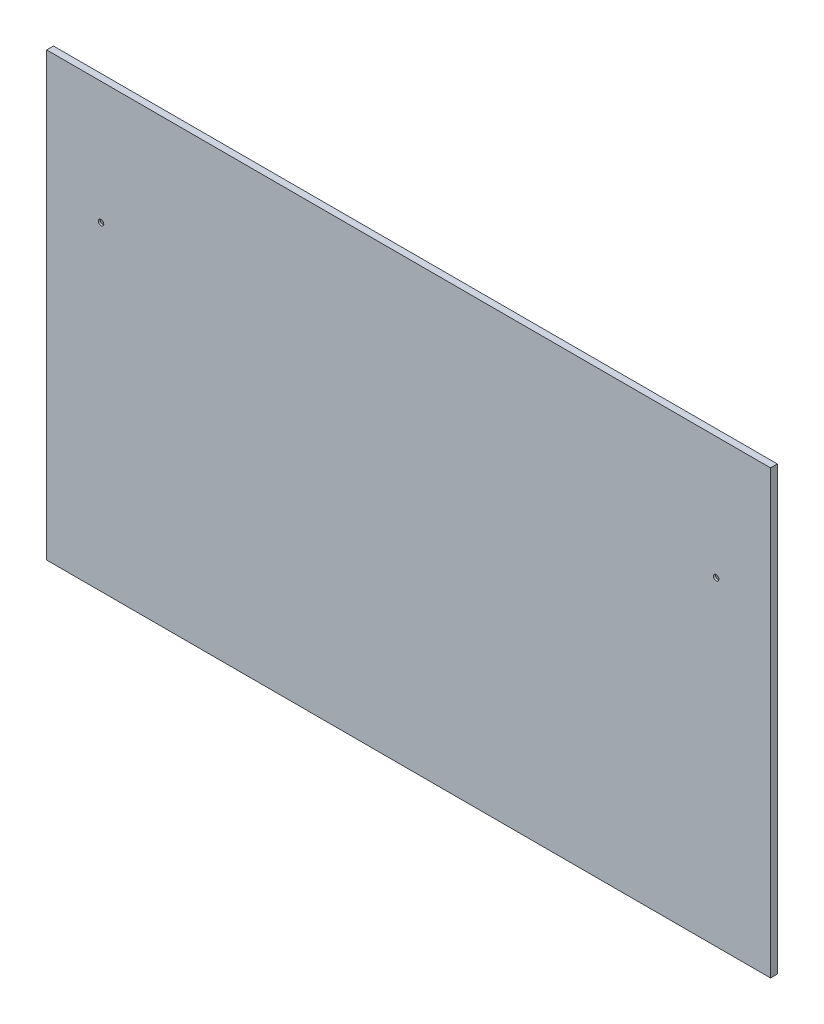
ISO-10303-21;
HEADER;
FILE_DESCRIPTION(('STEP AP214'),'2;1');
FILE_NAME('part.step','',(''),(''),'','','');
FILE_SCHEMA(('AUTOMOTIVE_DESIGN { 1 0 10303 214 1 1 1 1 }'));
ENDSEC;
DATA;
#1=APPLICATION_CONTEXT('core data for automotive mechanical design processes');
#2=APPLICATION_PROTOCOL_DEFINITION('international standard','automotive_design',2000,#1);
#3=PRODUCT_CONTEXT('',#1,'mechanical');
#4=PRODUCT('Part','Part','',(#3));
#5=PRODUCT_RELATED_PRODUCT_CATEGORY('part','',(#4));
#6=PRODUCT_DEFINITION_FORMATION('','',#4);
#7=PRODUCT_DEFINITION_CONTEXT('part definition',#1,'design');
#8=PRODUCT_DEFINITION('design','',#6,#7);
#9=PRODUCT_DEFINITION_SHAPE('','',#8);
#10=(LENGTH_UNIT() NAMED_UNIT(*) SI_UNIT(.MILLI.,.METRE.));
#11=(NAMED_UNIT(*) PLANE_ANGLE_UNIT() SI_UNIT($,.RADIAN.));
#12=(NAMED_UNIT(*) SI_UNIT($,.STERADIAN.) SOLID_ANGLE_UNIT());
#13=UNCERTAINTY_MEASURE_WITH_UNIT(LENGTH_MEASURE(1.E-05),#10,'distance_accuracy_value','');
#14=(GEOMETRIC_REPRESENTATION_CONTEXT(3) GLOBAL_UNCERTAINTY_ASSIGNED_CONTEXT((#13)) GLOBAL_UNIT_ASSIGNED_CONTEXT((#10,
#11,#12)) REPRESENTATION_CONTEXT('',''));
#15=CARTESIAN_POINT('',(0.,0.,0.));
#16=DIRECTION('',(0.,0.,1.));
#17=DIRECTION('',(1.,0.,0.));
#18=AXIS2_PLACEMENT_3D('',#15,#16,#17);
#19=CARTESIAN_POINT('',(0.,0.,0.));
#20=DIRECTION('',(0.,0.,1.));
#21=DIRECTION('',(1.,0.,0.));
#22=AXIS2_PLACEMENT_3D('',#19,#20,#21);
#23=PLANE('',#22);
#24=CARTESIAN_POINT('',(-287.3375,104.775,5.6843418860808E-11));
#25=DIRECTION('',(0.,0.,-1.));
#26=DIRECTION('',(-1.,0.,0.));
#27=AXIS2_PLACEMENT_3D('',#24,#25,#26);
#28=CIRCLE('',#27,6.43889999993525);
#29=CARTESIAN_POINT('',(-293.776399999935,104.775,5.6843418860808E-11));
#30=VERTEX_POINT('',#29);
#31=EDGE_CURVE('P0_E68',#30,#30,#28,.F.);
#32=ORIENTED_EDGE('',*,*,#31,.T.);
#33=EDGE_LOOP('',(#32));
#34=FACE_BOUND('',#33,.T.);
#35=CARTESIAN_POINT('',(287.3375,104.775,5.6843418860808E-11));
#36=DIRECTION('',(0.,0.,-1.));
#37=DIRECTION('',(-1.,0.,0.));
#38=AXIS2_PLACEMENT_3D('',#35,#36,#37);
#39=CIRCLE('',#38,6.43889999994869);
#40=CARTESIAN_POINT('',(280.898600000051,104.775,5.6843418860808E-11));
#41=VERTEX_POINT('',#40);
#42=EDGE_CURVE('P0_E19',#41,#41,#39,.F.);
#43=ORIENTED_EDGE('',*,*,#42,.T.);
#44=EDGE_LOOP('',(#43));
#45=FACE_BOUND('',#44,.T.);
#46=DIRECTION('',(0.,1.,0.));
#47=VECTOR('',#46,1.);
#48=CARTESIAN_POINT('',(338.1375,-193.675,0.));
#49=LINE('',#48,#47);
#50=CARTESIAN_POINT('',(338.1375,-193.675,0.));
#51=VERTEX_POINT('',#50);
#52=CARTESIAN_POINT('',(338.1375,219.075,0.));
#53=VERTEX_POINT('',#52);
#54=EDGE_CURVE('P0_E54',#51,#53,#49,.T.);
#55=ORIENTED_EDGE('',*,*,#54,.F.);
#56=DIRECTION('',(1.,0.,0.));
#57=VECTOR('',#56,1.);
#58=CARTESIAN_POINT('',(-338.1375,-193.675,0.));
#59=LINE('',#58,#57);
#60=CARTESIAN_POINT('',(-338.1375,-193.675,0.));
#61=VERTEX_POINT('',#60);
#62=EDGE_CURVE('P0_E59',#61,#51,#59,.T.);
#63=ORIENTED_EDGE('',*,*,#62,.F.);
#64=DIRECTION('',(0.,1.,0.));
#65=VECTOR('',#64,1.);
#66=CARTESIAN_POINT('',(-338.1375,219.075,0.));
#67=LINE('',#66,#65);
#68=CARTESIAN_POINT('',(-338.1375,219.075,0.));
#69=VERTEX_POINT('',#68);
#70=EDGE_CURVE('P0_E87',#69,#61,#67,.F.);
#71=ORIENTED_EDGE('',*,*,#70,.F.);
#72=DIRECTION('',(1.,0.,0.));
#73=VECTOR('',#72,1.);
#74=CARTESIAN_POINT('',(338.1375,219.075,0.));
#75=LINE('',#74,#73);
#76=EDGE_CURVE('P0_E70',#53,#69,#75,.F.);
#77=ORIENTED_EDGE('',*,*,#76,.F.);
#78=EDGE_LOOP('',(#55,#63,#71,#77));
#79=FACE_BOUND('',#78,.T.);
#80=ADVANCED_FACE('P0_F16',(#34,#45,#79),#23,.F.);
#81=CARTESIAN_POINT('',(287.3375,104.775,1.13686837721616E-10));
#82=DIRECTION('',(0.,0.,-1.));
#83=DIRECTION('',(-1.,0.,0.));
#84=AXIS2_PLACEMENT_3D('',#81,#82,#83);
#85=CONICAL_SURFACE('',#84,6.43889999989927,0.715584993311887);
#86=CARTESIAN_POINT('',(287.3375,104.775,4.47056170414192));
#87=DIRECTION('',(0.,0.,-1.));
#88=DIRECTION('',(-1.,0.,0.));
#89=AXIS2_PLACEMENT_3D('',#86,#87,#88);
#90=CIRCLE('',#89,2.5527);
#91=CARTESIAN_POINT('',(284.7848,104.775,4.47056170414192));
#92=VERTEX_POINT('',#91);
#93=EDGE_CURVE('P0_E85',#92,#92,#90,.F.);
#94=ORIENTED_EDGE('',*,*,#93,.T.);
#95=EDGE_LOOP('',(#94));
#96=FACE_BOUND('',#95,.T.);
#97=ORIENTED_EDGE('',*,*,#42,.F.);
#98=EDGE_LOOP('',(#97));
#99=FACE_BOUND('',#98,.T.);
#100=ADVANCED_FACE('P0_F98',(#96,#99),#85,.F.);
#101=CARTESIAN_POINT('',(-287.3375,104.775,1.13686837721616E-10));
#102=DIRECTION('',(0.,0.,-1.));
#103=DIRECTION('',(-1.,0.,0.));
#104=AXIS2_PLACEMENT_3D('',#101,#102,#103);
#105=CONICAL_SURFACE('',#104,6.43889999988584,0.715584993311887);
#106=CARTESIAN_POINT('',(-287.3375,104.775,4.47056170414192));
#107=DIRECTION('',(0.,0.,-1.));
#108=DIRECTION('',(-1.,0.,0.));
#109=AXIS2_PLACEMENT_3D('',#106,#107,#108);
#110=CIRCLE('',#109,2.5527);
#111=CARTESIAN_POINT('',(-289.8902,104.775,4.47056170414192));
#112=VERTEX_POINT('',#111);
#113=EDGE_CURVE('P0_E81',#112,#112,#110,.F.);
#114=ORIENTED_EDGE('',*,*,#113,.T.);
#115=EDGE_LOOP('',(#114));
#116=FACE_BOUND('',#115,.T.);
#117=ORIENTED_EDGE('',*,*,#31,.F.);
#118=EDGE_LOOP('',(#117));
#119=FACE_BOUND('',#118,.T.);
#120=ADVANCED_FACE('P0_F100',(#116,#119),#105,.F.);
#121=CARTESIAN_POINT('',(-338.1375,-193.675,0.));
#122=DIRECTION('',(0.,-1.,0.));
#123=DIRECTION('',(0.,0.,-1.));
#124=AXIS2_PLACEMENT_3D('',#121,#122,#123);
#125=PLANE('',#124);
#126=DIRECTION('',(0.,0.,1.));
#127=VECTOR('',#126,1.);
#128=CARTESIAN_POINT('',(-338.1375,-193.675,0.));
#129=LINE('',#128,#127);
#130=CARTESIAN_POINT('',(-338.1375,-193.675,6.35));
#131=VERTEX_POINT('',#130);
#132=EDGE_CURVE('P0_E64',#61,#131,#129,.T.);
#133=ORIENTED_EDGE('',*,*,#132,.F.);
#134=ORIENTED_EDGE('',*,*,#62,.T.);
#135=DIRECTION('',(0.,0.,-1.));
#136=VECTOR('',#135,1.);
#137=CARTESIAN_POINT('',(338.1375,-193.675,0.));
#138=LINE('',#137,#136);
#139=CARTESIAN_POINT('',(338.1375,-193.675,6.35));
#140=VERTEX_POINT('',#139);
#141=EDGE_CURVE('P0_E61',#140,#51,#138,.T.);
#142=ORIENTED_EDGE('',*,*,#141,.F.);
#143=DIRECTION('',(1.,0.,0.));
#144=VECTOR('',#143,1.);
#145=CARTESIAN_POINT('',(0.,-193.675,6.35));
#146=LINE('',#145,#144);
#147=EDGE_CURVE('P0_E84',#131,#140,#146,.T.);
#148=ORIENTED_EDGE('',*,*,#147,.F.);
#149=EDGE_LOOP('',(#133,#134,#142,#148));
#150=FACE_BOUND('',#149,.T.);
#151=ADVANCED_FACE('P0_F60',(#150),#125,.T.);
#152=CARTESIAN_POINT('',(338.1375,-193.675,0.));
#153=DIRECTION('',(1.,0.,0.));
#154=DIRECTION('',(0.,0.,-1.));
#155=AXIS2_PLACEMENT_3D('',#152,#153,#154);
#156=PLANE('',#155);
#157=ORIENTED_EDGE('',*,*,#141,.T.);
#158=ORIENTED_EDGE('',*,*,#54,.T.);
#159=DIRECTION('',(0.,0.,1.));
#160=VECTOR('',#159,1.);
#161=CARTESIAN_POINT('',(338.1375,219.075,0.));
#162=LINE('',#161,#160);
#163=CARTESIAN_POINT('',(338.1375,219.075,6.35));
#164=VERTEX_POINT('',#163);
#165=EDGE_CURVE('P0_E72',#164,#53,#162,.F.);
#166=ORIENTED_EDGE('',*,*,#165,.F.);
#167=DIRECTION('',(0.,1.,0.));
#168=VECTOR('',#167,1.);
#169=CARTESIAN_POINT('',(338.1375,0.,6.35));
#170=LINE('',#169,#168);
#171=EDGE_CURVE('P0_E76',#140,#164,#170,.T.);
#172=ORIENTED_EDGE('',*,*,#171,.F.);
#173=EDGE_LOOP('',(#157,#158,#166,#172));
#174=FACE_BOUND('',#173,.T.);
#175=ADVANCED_FACE('P0_F74',(#174),#156,.T.);
#176=CARTESIAN_POINT('',(338.1375,219.075,0.));
#177=DIRECTION('',(0.,1.,0.));
#178=DIRECTION('',(0.,0.,1.));
#179=AXIS2_PLACEMENT_3D('',#176,#177,#178);
#180=PLANE('',#179);
#181=ORIENTED_EDGE('',*,*,#165,.T.);
#182=ORIENTED_EDGE('',*,*,#76,.T.);
#183=DIRECTION('',(0.,0.,1.));
#184=VECTOR('',#183,1.);
#185=CARTESIAN_POINT('',(-338.1375,219.075,0.));
#186=LINE('',#185,#184);
#187=CARTESIAN_POINT('',(-338.1375,219.075,6.35));
#188=VERTEX_POINT('',#187);
#189=EDGE_CURVE('P0_E34',#188,#69,#186,.F.);
#190=ORIENTED_EDGE('',*,*,#189,.F.);
#191=DIRECTION('',(1.,0.,0.));
#192=VECTOR('',#191,1.);
#193=CARTESIAN_POINT('',(0.,219.075,6.35));
#194=LINE('',#193,#192);
#195=EDGE_CURVE('P0_E199',#164,#188,#194,.F.);
#196=ORIENTED_EDGE('',*,*,#195,.F.);
#197=EDGE_LOOP('',(#181,#182,#190,#196));
#198=FACE_BOUND('',#197,.T.);
#199=ADVANCED_FACE('P0_F128',(#198),#180,.T.);
#200=CARTESIAN_POINT('',(-338.1375,219.075,0.));
#201=DIRECTION('',(-1.,0.,0.));
#202=DIRECTION('',(0.,0.,1.));
#203=AXIS2_PLACEMENT_3D('',#200,#201,#202);
#204=PLANE('',#203);
#205=ORIENTED_EDGE('',*,*,#189,.T.);
#206=ORIENTED_EDGE('',*,*,#70,.T.);
#207=ORIENTED_EDGE('',*,*,#132,.T.);
#208=DIRECTION('',(0.,1.,0.));
#209=VECTOR('',#208,1.);
#210=CARTESIAN_POINT('',(-338.1375,0.,6.35));
#211=LINE('',#210,#209);
#212=EDGE_CURVE('P0_E90',#188,#131,#211,.F.);
#213=ORIENTED_EDGE('',*,*,#212,.F.);
#214=EDGE_LOOP('',(#205,#206,#207,#213));
#215=FACE_BOUND('',#214,.T.);
#216=ADVANCED_FACE('P0_F124',(#215),#204,.T.);
#217=CARTESIAN_POINT('',(287.3375,104.775,6.6675));
#218=DIRECTION('',(0.,0.,-1.));
#219=DIRECTION('',(-1.,0.,0.));
#220=AXIS2_PLACEMENT_3D('',#217,#218,#219);
#221=CYLINDRICAL_SURFACE('',#220,2.5527);
#222=ORIENTED_EDGE('',*,*,#93,.F.);
#223=EDGE_LOOP('',(#222));
#224=FACE_BOUND('',#223,.T.);
#225=CARTESIAN_POINT('',(287.3375,104.775,6.35));
#226=DIRECTION('',(0.,0.,-1.));
#227=DIRECTION('',(-1.,0.,0.));
#228=AXIS2_PLACEMENT_3D('',#225,#226,#227);
#229=CIRCLE('',#228,2.5527);
#230=CARTESIAN_POINT('',(284.7848,104.775,6.35));
#231=VERTEX_POINT('',#230);
#232=EDGE_CURVE('P0_E25',#231,#231,#229,.T.);
#233=ORIENTED_EDGE('',*,*,#232,.F.);
#234=EDGE_LOOP('',(#233));
#235=FACE_BOUND('',#234,.T.);
#236=ADVANCED_FACE('P0_F117',(#224,#235),#221,.F.);
#237=CARTESIAN_POINT('',(-287.3375,104.775,6.6675));
#238=DIRECTION('',(0.,0.,-1.));
#239=DIRECTION('',(-1.,0.,0.));
#240=AXIS2_PLACEMENT_3D('',#237,#238,#239);
#241=CYLINDRICAL_SURFACE('',#240,2.5527);
#242=CARTESIAN_POINT('',(-287.3375,104.775,6.35));
#243=DIRECTION('',(0.,0.,-1.));
#244=DIRECTION('',(-1.,0.,0.));
#245=AXIS2_PLACEMENT_3D('',#242,#243,#244);
#246=CIRCLE('',#245,2.5527);
#247=CARTESIAN_POINT('',(-289.8902,104.775,6.35));
#248=VERTEX_POINT('',#247);
#249=EDGE_CURVE('P0_E11',#248,#248,#246,.T.);
#250=ORIENTED_EDGE('',*,*,#249,.F.);
#251=EDGE_LOOP('',(#250));
#252=FACE_BOUND('',#251,.T.);
#253=ORIENTED_EDGE('',*,*,#113,.F.);
#254=EDGE_LOOP('',(#253));
#255=FACE_BOUND('',#254,.T.);
#256=ADVANCED_FACE('P0_F111',(#252,#255),#241,.F.);
#257=CARTESIAN_POINT('',(0.,0.,6.35));
#258=DIRECTION('',(0.,0.,1.));
#259=DIRECTION('',(1.,0.,0.));
#260=AXIS2_PLACEMENT_3D('',#257,#258,#259);
#261=PLANE('',#260);
#262=ORIENTED_EDGE('',*,*,#249,.T.);
#263=EDGE_LOOP('',(#262));
#264=FACE_BOUND('',#263,.T.);
#265=ORIENTED_EDGE('',*,*,#232,.T.);
#266=EDGE_LOOP('',(#265));
#267=FACE_BOUND('',#266,.T.);
#268=ORIENTED_EDGE('',*,*,#195,.T.);
#269=ORIENTED_EDGE('',*,*,#212,.T.);
#270=ORIENTED_EDGE('',*,*,#147,.T.);
#271=ORIENTED_EDGE('',*,*,#171,.T.);
#272=EDGE_LOOP('',(#268,#269,#270,#271));
#273=FACE_BOUND('',#272,.T.);
#274=ADVANCED_FACE('P0_F109',(#264,#267,#273),#261,.T.);
#275=CLOSED_SHELL('',(#80,#100,#120,#151,#175,#199,#216,#236,#256,#274));
#276=MANIFOLD_SOLID_BREP('P0_B1',#275);
#277=CARTESIAN_POINT('',(-287.3375,104.775,6.6675));
#278=DIRECTION('',(0.,0.,-1.));
#279=DIRECTION('',(-1.,0.,0.));
#280=AXIS2_PLACEMENT_3D('',#277,#278,#279);
#281=CYLINDRICAL_SURFACE('',#280,3.175);
#282=CARTESIAN_POINT('',(-287.3375,104.775,6.35));
#283=DIRECTION('',(0.,0.,-1.));
#284=DIRECTION('',(-1.,0.,0.));
#285=AXIS2_PLACEMENT_3D('',#282,#283,#284);
#286=CIRCLE('',#285,3.175);
#287=CARTESIAN_POINT('',(-290.5125,104.775,6.35));
#288=VERTEX_POINT('',#287);
#289=EDGE_CURVE('P1_E10',#288,#288,#286,.T.);
#290=ORIENTED_EDGE('',*,*,#289,.T.);
#291=EDGE_LOOP('',(#290));
#292=FACE_BOUND('',#291,.T.);
#293=CARTESIAN_POINT('',(-287.3375,104.775,3.75468744432866));
#294=DIRECTION('',(0.,0.,-1.));
#295=DIRECTION('',(-1.,0.,0.));
#296=AXIS2_PLACEMENT_3D('',#293,#294,#295);
#297=CIRCLE('',#296,3.175);
#298=CARTESIAN_POINT('',(-290.5125,104.775,3.75468744432866));
#299=VERTEX_POINT('',#298);
#300=EDGE_CURVE('P1_E15',#299,#299,#297,.F.);
#301=ORIENTED_EDGE('',*,*,#300,.T.);
#302=EDGE_LOOP('',(#301));
#303=FACE_BOUND('',#302,.T.);
#304=ADVANCED_FACE('P1_F14',(#292,#303),#281,.T.);
#305=OPEN_SHELL('',(#304));
#306=SHELL_BASED_SURFACE_MODEL('P1_B1',(#305));
#307=CARTESIAN_POINT('',(287.3375,104.775,6.6675));
#308=DIRECTION('',(0.,0.,-1.));
#309=DIRECTION('',(-1.,0.,0.));
#310=AXIS2_PLACEMENT_3D('',#307,#308,#309);
#311=CYLINDRICAL_SURFACE('',#310,3.175);
#312=CARTESIAN_POINT('',(287.3375,104.775,6.35));
#313=DIRECTION('',(0.,0.,-1.));
#314=DIRECTION('',(-1.,0.,0.));
#315=AXIS2_PLACEMENT_3D('',#312,#313,#314);
#316=CIRCLE('',#315,3.175);
#317=CARTESIAN_POINT('',(284.1625,104.775,6.35));
#318=VERTEX_POINT('',#317);
#319=EDGE_CURVE('P2_E10',#318,#318,#316,.T.);
#320=ORIENTED_EDGE('',*,*,#319,.T.);
#321=EDGE_LOOP('',(#320));
#322=FACE_BOUND('',#321,.T.);
#323=CARTESIAN_POINT('',(287.3375,104.775,3.75468744432866));
#324=DIRECTION('',(0.,0.,-1.));
#325=DIRECTION('',(-1.,0.,0.));
#326=AXIS2_PLACEMENT_3D('',#323,#324,#325);
#327=CIRCLE('',#326,3.175);
#328=CARTESIAN_POINT('',(284.1625,104.775,3.75468744432866));
#329=VERTEX_POINT('',#328);
#330=EDGE_CURVE('P2_E15',#329,#329,#327,.F.);
#331=ORIENTED_EDGE('',*,*,#330,.T.);
#332=EDGE_LOOP('',(#331));
#333=FACE_BOUND('',#332,.T.);
#334=ADVANCED_FACE('P2_F14',(#322,#333),#311,.T.);
#335=OPEN_SHELL('',(#334));
#336=SHELL_BASED_SURFACE_MODEL('P2_B1',(#335));
#337=ADVANCED_BREP_SHAPE_REPRESENTATION('',(#18,#276),#14);
#338=MANIFOLD_SURFACE_SHAPE_REPRESENTATION('',(#18,#306,#336),#14);
#339=SHAPE_REPRESENTATION('',(#18),#14);
#340=SHAPE_DEFINITION_REPRESENTATION(#9,#339);
#341=SHAPE_REPRESENTATION_RELATIONSHIP('','',#339,#337);
#342=SHAPE_REPRESENTATION_RELATIONSHIP('','',#339,#338);
ENDSEC;
END-ISO-10303-21;
